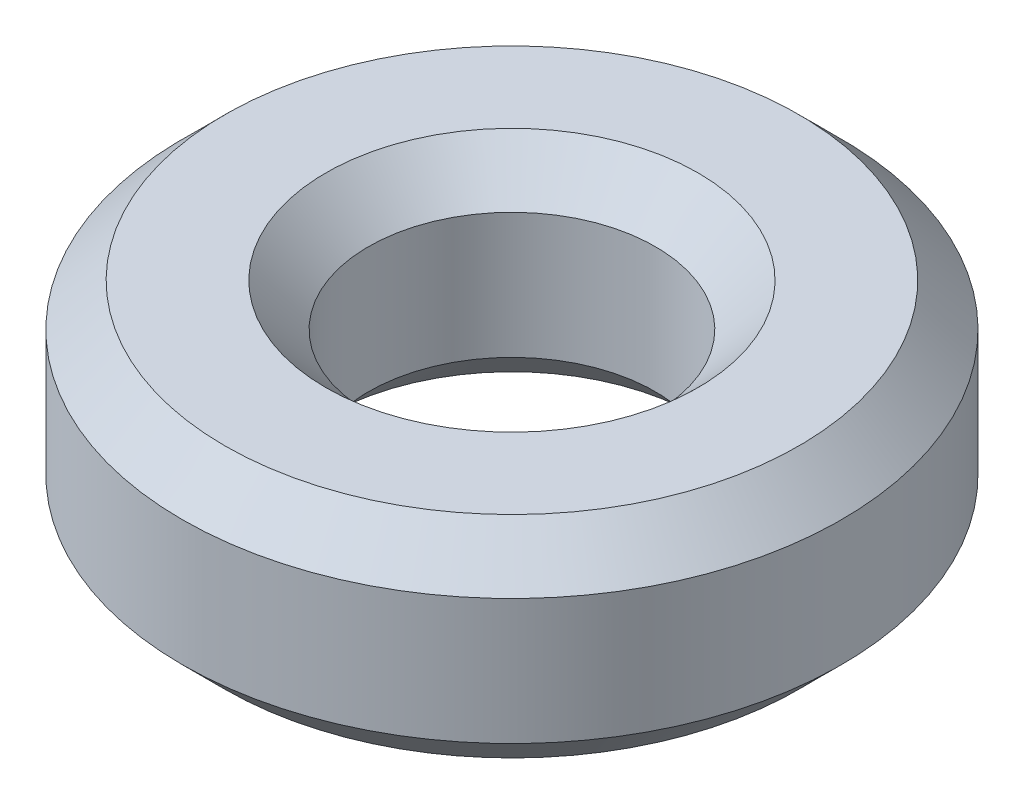
ISO-10303-21;
HEADER;
FILE_DESCRIPTION(('STEP AP214'),'2;1');
FILE_NAME('part.step','',(''),(''),'','','');
FILE_SCHEMA(('AUTOMOTIVE_DESIGN { 1 0 10303 214 1 1 1 1 }'));
ENDSEC;
DATA;
#1=APPLICATION_CONTEXT('core data for automotive mechanical design processes');
#2=APPLICATION_PROTOCOL_DEFINITION('international standard','automotive_design',2000,#1);
#3=PRODUCT_CONTEXT('',#1,'mechanical');
#4=PRODUCT('Part','Part','',(#3));
#5=PRODUCT_RELATED_PRODUCT_CATEGORY('part','',(#4));
#6=PRODUCT_DEFINITION_FORMATION('','',#4);
#7=PRODUCT_DEFINITION_CONTEXT('part definition',#1,'design');
#8=PRODUCT_DEFINITION('design','',#6,#7);
#9=PRODUCT_DEFINITION_SHAPE('','',#8);
#10=(LENGTH_UNIT() NAMED_UNIT(*) SI_UNIT(.MILLI.,.METRE.));
#11=(NAMED_UNIT(*) PLANE_ANGLE_UNIT() SI_UNIT($,.RADIAN.));
#12=(NAMED_UNIT(*) SI_UNIT($,.STERADIAN.) SOLID_ANGLE_UNIT());
#13=UNCERTAINTY_MEASURE_WITH_UNIT(LENGTH_MEASURE(1.E-05),#10,'distance_accuracy_value','');
#14=(GEOMETRIC_REPRESENTATION_CONTEXT(3) GLOBAL_UNCERTAINTY_ASSIGNED_CONTEXT((#13)) GLOBAL_UNIT_ASSIGNED_CONTEXT((#10,
#11,#12)) REPRESENTATION_CONTEXT('',''));
#15=CARTESIAN_POINT('',(0.,0.,0.));
#16=DIRECTION('',(0.,0.,1.));
#17=DIRECTION('',(1.,0.,0.));
#18=AXIS2_PLACEMENT_3D('',#15,#16,#17);
#19=CARTESIAN_POINT('',(0.,12.7937940570837,0.));
#20=DIRECTION('',(0.,-1.,0.));
#21=DIRECTION('',(0.,0.,-1.));
#22=AXIS2_PLACEMENT_3D('',#19,#20,#21);
#23=CYLINDRICAL_SURFACE('',#22,20.);
#24=CARTESIAN_POINT('',(0.,2.58518321386101,0.));
#25=DIRECTION('',(0.,1.,0.));
#26=DIRECTION('',(0.,0.,1.));
#27=AXIS2_PLACEMENT_3D('',#24,#25,#26);
#28=CIRCLE('',#27,20.);
#29=CARTESIAN_POINT('',(0.,2.58518321386101,20.));
#30=VERTEX_POINT('',#29);
#31=EDGE_CURVE('E10',#30,#30,#28,.T.);
#32=ORIENTED_EDGE('',*,*,#31,.T.);
#33=EDGE_LOOP('',(#32));
#34=FACE_BOUND('',#33,.T.);
#35=CARTESIAN_POINT('',(0.,10.2086108432226,0.));
#36=DIRECTION('',(0.,1.,0.));
#37=DIRECTION('',(0.,0.,1.));
#38=AXIS2_PLACEMENT_3D('',#35,#36,#37);
#39=CIRCLE('',#38,20.);
#40=CARTESIAN_POINT('',(0.,10.2086108432226,20.));
#41=VERTEX_POINT('',#40);
#42=EDGE_CURVE('E50',#41,#41,#39,.F.);
#43=ORIENTED_EDGE('',*,*,#42,.T.);
#44=EDGE_LOOP('',(#43));
#45=FACE_BOUND('',#44,.T.);
#46=ADVANCED_FACE('F39',(#34,#45),#23,.T.);
#47=CARTESIAN_POINT('',(0.,12.7937940570837,0.));
#48=DIRECTION('',(0.,1.,0.));
#49=DIRECTION('',(0.,0.,1.));
#50=AXIS2_PLACEMENT_3D('',#47,#48,#49);
#51=PLANE('',#50);
#52=CARTESIAN_POINT('',(0.,12.7937940570837,0.));
#53=DIRECTION('',(0.,1.,0.));
#54=DIRECTION('',(0.,0.,1.));
#55=AXIS2_PLACEMENT_3D('',#52,#53,#54);
#56=CIRCLE('',#55,11.2925161491099);
#57=CARTESIAN_POINT('',(0.,12.7937940570837,11.2925161491099));
#58=VERTEX_POINT('',#57);
#59=EDGE_CURVE('E58',#58,#58,#56,.F.);
#60=ORIENTED_EDGE('',*,*,#59,.T.);
#61=EDGE_LOOP('',(#60));
#62=FACE_BOUND('',#61,.T.);
#63=CARTESIAN_POINT('',(0.,12.7937940570837,0.));
#64=DIRECTION('',(0.,1.,0.));
#65=DIRECTION('',(0.,0.,1.));
#66=AXIS2_PLACEMENT_3D('',#63,#64,#65);
#67=CIRCLE('',#66,17.414816786139);
#68=CARTESIAN_POINT('',(0.,12.7937940570837,17.414816786139));
#69=VERTEX_POINT('',#68);
#70=EDGE_CURVE('E61',#69,#69,#67,.T.);
#71=ORIENTED_EDGE('',*,*,#70,.T.);
#72=EDGE_LOOP('',(#71));
#73=FACE_BOUND('',#72,.T.);
#74=ADVANCED_FACE('F88',(#62,#73),#51,.T.);
#75=CARTESIAN_POINT('',(0.,0.,0.));
#76=DIRECTION('',(0.,1.,0.));
#77=DIRECTION('',(0.,0.,1.));
#78=AXIS2_PLACEMENT_3D('',#75,#76,#77);
#79=PLANE('',#78);
#80=CARTESIAN_POINT('',(0.,0.,0.));
#81=DIRECTION('',(0.,1.,0.));
#82=DIRECTION('',(0.,0.,1.));
#83=AXIS2_PLACEMENT_3D('',#80,#81,#82);
#84=CIRCLE('',#83,11.2925161491099);
#85=CARTESIAN_POINT('',(0.,0.,11.2925161491099));
#86=VERTEX_POINT('',#85);
#87=EDGE_CURVE('E51',#86,#86,#84,.T.);
#88=ORIENTED_EDGE('',*,*,#87,.T.);
#89=EDGE_LOOP('',(#88));
#90=FACE_BOUND('',#89,.T.);
#91=CARTESIAN_POINT('',(0.,0.,0.));
#92=DIRECTION('',(0.,1.,0.));
#93=DIRECTION('',(0.,0.,1.));
#94=AXIS2_PLACEMENT_3D('',#91,#92,#93);
#95=CIRCLE('',#94,17.414816786139);
#96=CARTESIAN_POINT('',(0.,0.,17.414816786139));
#97=VERTEX_POINT('',#96);
#98=EDGE_CURVE('E54',#97,#97,#95,.F.);
#99=ORIENTED_EDGE('',*,*,#98,.T.);
#100=EDGE_LOOP('',(#99));
#101=FACE_BOUND('',#100,.T.);
#102=ADVANCED_FACE('F83',(#90,#101),#79,.F.);
#103=CARTESIAN_POINT('',(0.,12.7937940570837,0.));
#104=DIRECTION('',(0.,-1.,0.));
#105=DIRECTION('',(0.,0.,-1.));
#106=AXIS2_PLACEMENT_3D('',#103,#104,#105);
#107=CYLINDRICAL_SURFACE('',#106,8.70733293524889);
#108=CARTESIAN_POINT('',(0.,10.2086108432226,0.));
#109=DIRECTION('',(0.,1.,0.));
#110=DIRECTION('',(0.,0.,1.));
#111=AXIS2_PLACEMENT_3D('',#108,#109,#110);
#112=CIRCLE('',#111,8.70733293524889);
#113=CARTESIAN_POINT('',(0.,10.2086108432226,8.70733293524889));
#114=VERTEX_POINT('',#113);
#115=EDGE_CURVE('E67',#114,#114,#112,.T.);
#116=ORIENTED_EDGE('',*,*,#115,.T.);
#117=EDGE_LOOP('',(#116));
#118=FACE_BOUND('',#117,.T.);
#119=CARTESIAN_POINT('',(0.,2.58518321386103,0.));
#120=DIRECTION('',(0.,1.,0.));
#121=DIRECTION('',(0.,0.,1.));
#122=AXIS2_PLACEMENT_3D('',#119,#120,#121);
#123=CIRCLE('',#122,8.70733293524889);
#124=CARTESIAN_POINT('',(0.,2.58518321386103,8.70733293524889));
#125=VERTEX_POINT('',#124);
#126=EDGE_CURVE('E69',#125,#125,#123,.F.);
#127=ORIENTED_EDGE('',*,*,#126,.T.);
#128=EDGE_LOOP('',(#127));
#129=FACE_BOUND('',#128,.T.);
#130=ADVANCED_FACE('F71',(#118,#129),#107,.F.);
#131=CARTESIAN_POINT('',(0.,10.2086108432226,0.));
#132=DIRECTION('',(0.,1.,0.));
#133=DIRECTION('',(0.,0.,1.));
#134=AXIS2_PLACEMENT_3D('',#131,#132,#133);
#135=CONICAL_SURFACE('',#134,8.70733293524889,0.785398163397452);
#136=ORIENTED_EDGE('',*,*,#59,.F.);
#137=EDGE_LOOP('',(#136));
#138=FACE_BOUND('',#137,.T.);
#139=ORIENTED_EDGE('',*,*,#115,.F.);
#140=EDGE_LOOP('',(#139));
#141=FACE_BOUND('',#140,.T.);
#142=ADVANCED_FACE('F77',(#138,#141),#135,.F.);
#143=CARTESIAN_POINT('',(0.,0.,0.));
#144=DIRECTION('',(0.,-1.,0.));
#145=DIRECTION('',(0.,0.,-1.));
#146=AXIS2_PLACEMENT_3D('',#143,#144,#145);
#147=CONICAL_SURFACE('',#146,11.2925161491099,0.785398163397445);
#148=ORIENTED_EDGE('',*,*,#126,.F.);
#149=EDGE_LOOP('',(#148));
#150=FACE_BOUND('',#149,.T.);
#151=ORIENTED_EDGE('',*,*,#87,.F.);
#152=EDGE_LOOP('',(#151));
#153=FACE_BOUND('',#152,.T.);
#154=ADVANCED_FACE('F73',(#150,#153),#147,.F.);
#155=CARTESIAN_POINT('',(0.,2.58518321386101,0.));
#156=DIRECTION('',(0.,1.,0.));
#157=DIRECTION('',(0.,0.,1.));
#158=AXIS2_PLACEMENT_3D('',#155,#156,#157);
#159=CONICAL_SURFACE('',#158,20.,0.785398163397452);
#160=ORIENTED_EDGE('',*,*,#98,.F.);
#161=EDGE_LOOP('',(#160));
#162=FACE_BOUND('',#161,.T.);
#163=ORIENTED_EDGE('',*,*,#31,.F.);
#164=EDGE_LOOP('',(#163));
#165=FACE_BOUND('',#164,.T.);
#166=ADVANCED_FACE('F76',(#162,#165),#159,.T.);
#167=CARTESIAN_POINT('',(0.,12.7937940570837,0.));
#168=DIRECTION('',(0.,-1.,0.));
#169=DIRECTION('',(0.,0.,-1.));
#170=AXIS2_PLACEMENT_3D('',#167,#168,#169);
#171=CONICAL_SURFACE('',#170,17.414816786139,0.785398163397445);
#172=ORIENTED_EDGE('',*,*,#42,.F.);
#173=EDGE_LOOP('',(#172));
#174=FACE_BOUND('',#173,.T.);
#175=ORIENTED_EDGE('',*,*,#70,.F.);
#176=EDGE_LOOP('',(#175));
#177=FACE_BOUND('',#176,.T.);
#178=ADVANCED_FACE('F45',(#174,#177),#171,.T.);
#179=CLOSED_SHELL('',(#46,#74,#102,#130,#142,#154,#166,#178));
#180=MANIFOLD_SOLID_BREP('B2',#179);
#181=ADVANCED_BREP_SHAPE_REPRESENTATION('',(#18,#180),#14);
#182=SHAPE_DEFINITION_REPRESENTATION(#9,#181);
ENDSEC;
END-ISO-10303-21;
